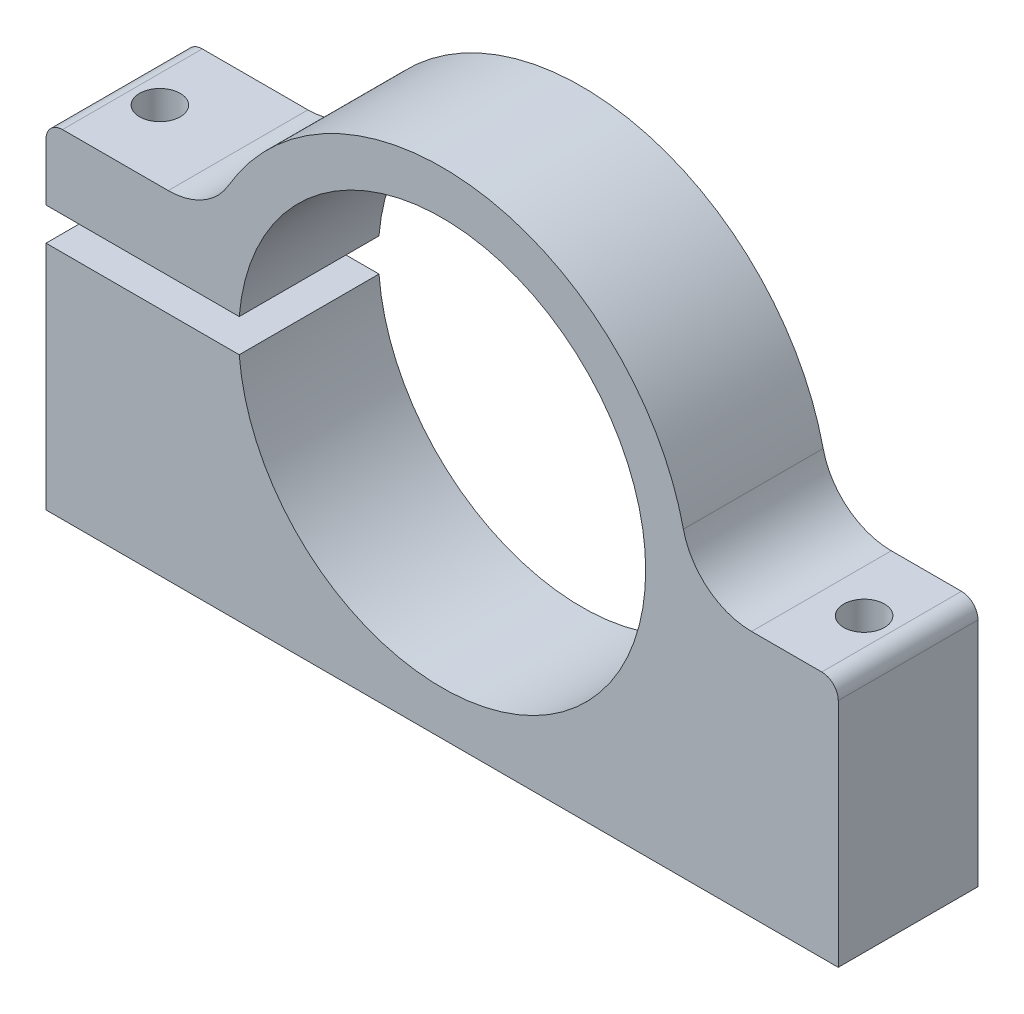
ISO-10303-21;
HEADER;
FILE_DESCRIPTION(('STEP AP214'),'2;1');
FILE_NAME('part.step','',(''),(''),'','','');
FILE_SCHEMA(('AUTOMOTIVE_DESIGN { 1 0 10303 214 1 1 1 1 }'));
ENDSEC;
DATA;
#1=APPLICATION_CONTEXT('core data for automotive mechanical design processes');
#2=APPLICATION_PROTOCOL_DEFINITION('international standard','automotive_design',2000,#1);
#3=PRODUCT_CONTEXT('',#1,'mechanical');
#4=PRODUCT('Part','Part','',(#3));
#5=PRODUCT_RELATED_PRODUCT_CATEGORY('part','',(#4));
#6=PRODUCT_DEFINITION_FORMATION('','',#4);
#7=PRODUCT_DEFINITION_CONTEXT('part definition',#1,'design');
#8=PRODUCT_DEFINITION('design','',#6,#7);
#9=PRODUCT_DEFINITION_SHAPE('','',#8);
#10=(LENGTH_UNIT() NAMED_UNIT(*) SI_UNIT(.MILLI.,.METRE.));
#11=(NAMED_UNIT(*) PLANE_ANGLE_UNIT() SI_UNIT($,.RADIAN.));
#12=(NAMED_UNIT(*) SI_UNIT($,.STERADIAN.) SOLID_ANGLE_UNIT());
#13=UNCERTAINTY_MEASURE_WITH_UNIT(LENGTH_MEASURE(1.E-05),#10,'distance_accuracy_value','');
#14=(GEOMETRIC_REPRESENTATION_CONTEXT(3) GLOBAL_UNCERTAINTY_ASSIGNED_CONTEXT((#13)) GLOBAL_UNIT_ASSIGNED_CONTEXT((#10,
#11,#12)) REPRESENTATION_CONTEXT('',''));
#15=CARTESIAN_POINT('',(0.,0.,0.));
#16=DIRECTION('',(0.,0.,1.));
#17=DIRECTION('',(1.,0.,0.));
#18=AXIS2_PLACEMENT_3D('',#15,#16,#17);
#19=CARTESIAN_POINT('',(-24.8593250544204,-22.3859153992928,0.400504127415026));
#20=DIRECTION('',(-1.,0.,0.));
#21=DIRECTION('',(0.,-1.,0.));
#22=AXIS2_PLACEMENT_3D('',#19,#20,#21);
#23=PLANE('',#22);
#24=DIRECTION('',(0.,1.,0.));
#25=VECTOR('',#24,1.);
#26=CARTESIAN_POINT('',(-24.8593250544204,-22.3859153992928,0.400504127415026));
#27=LINE('',#26,#25);
#28=CARTESIAN_POINT('',(-24.8593250544204,1.61408460070721,0.400504127415026));
#29=VERTEX_POINT('',#28);
#30=CARTESIAN_POINT('',(-24.8593250544204,6.80510216704338,0.400504127415026));
#31=VERTEX_POINT('',#30);
#32=EDGE_CURVE('E177',#29,#31,#27,.T.);
#33=ORIENTED_EDGE('',*,*,#32,.T.);
#34=DIRECTION('',(0.,0.,-1.));
#35=VECTOR('',#34,1.);
#36=CARTESIAN_POINT('',(-24.8593250544204,6.80510216704339,0.400504127415026));
#37=LINE('',#36,#35);
#38=CARTESIAN_POINT('',(-24.8593250544204,6.80510216704338,-12.299495872585));
#39=VERTEX_POINT('',#38);
#40=EDGE_CURVE('E209',#31,#39,#37,.T.);
#41=ORIENTED_EDGE('',*,*,#40,.T.);
#42=DIRECTION('',(0.,1.,0.));
#43=VECTOR('',#42,1.);
#44=CARTESIAN_POINT('',(-24.8593250544204,-22.3859153992928,-12.299495872585));
#45=LINE('',#44,#43);
#46=CARTESIAN_POINT('',(-24.8593250544204,1.61408460070721,-12.299495872585));
#47=VERTEX_POINT('',#46);
#48=EDGE_CURVE('E194',#47,#39,#45,.T.);
#49=ORIENTED_EDGE('',*,*,#48,.F.);
#50=DIRECTION('',(0.,0.,1.));
#51=VECTOR('',#50,1.);
#52=CARTESIAN_POINT('',(-24.8593250544204,1.61408460070721,-12.299495872585));
#53=LINE('',#52,#51);
#54=EDGE_CURVE('E160',#47,#29,#53,.T.);
#55=ORIENTED_EDGE('',*,*,#54,.T.);
#56=EDGE_LOOP('',(#33,#41,#49,#55));
#57=FACE_BOUND('',#56,.T.);
#58=ADVANCED_FACE('F34',(#57),#23,.T.);
#59=CARTESIAN_POINT('',(47.1406749455796,-22.3859153992928,0.400504127415026));
#60=DIRECTION('',(0.,-1.,0.));
#61=DIRECTION('',(0.,0.,-1.));
#62=AXIS2_PLACEMENT_3D('',#59,#60,#61);
#63=PLANE('',#62);
#64=CARTESIAN_POINT('',(-20.8593250544204,-22.3859153992928,-5.94949587258498));
#65=DIRECTION('',(0.,-1.,0.));
#66=DIRECTION('',(0.,0.,-1.));
#67=AXIS2_PLACEMENT_3D('',#64,#65,#66);
#68=CIRCLE('',#67,1.84999999999999);
#69=CARTESIAN_POINT('',(-20.8593250544204,-22.3859153992928,-7.79949587258497));
#70=VERTEX_POINT('',#69);
#71=EDGE_CURVE('E469',#70,#70,#68,.T.);
#72=ORIENTED_EDGE('',*,*,#71,.F.);
#73=EDGE_LOOP('',(#72));
#74=FACE_BOUND('',#73,.T.);
#75=CARTESIAN_POINT('',(43.1406749455796,-22.3859153992928,-5.94949587258498));
#76=DIRECTION('',(0.,1.,0.));
#77=DIRECTION('',(0.,0.,1.));
#78=AXIS2_PLACEMENT_3D('',#75,#76,#77);
#79=CIRCLE('',#78,1.84999999999998);
#80=CARTESIAN_POINT('',(43.1406749455796,-22.3859153992928,-4.09949587258499));
#81=VERTEX_POINT('',#80);
#82=EDGE_CURVE('E156',#81,#81,#79,.T.);
#83=ORIENTED_EDGE('',*,*,#82,.T.);
#84=EDGE_LOOP('',(#83));
#85=FACE_BOUND('',#84,.T.);
#86=DIRECTION('',(-1.,0.,0.));
#87=VECTOR('',#86,1.);
#88=CARTESIAN_POINT('',(47.1406749455796,-22.3859153992928,-12.299495872585));
#89=LINE('',#88,#87);
#90=CARTESIAN_POINT('',(47.1406749455796,-22.3859153992928,-12.299495872585));
#91=VERTEX_POINT('',#90);
#92=CARTESIAN_POINT('',(-24.8593250544204,-22.3859153992928,-12.299495872585));
#93=VERTEX_POINT('',#92);
#94=EDGE_CURVE('E144',#91,#93,#89,.T.);
#95=ORIENTED_EDGE('',*,*,#94,.F.);
#96=DIRECTION('',(0.,0.,-1.));
#97=VECTOR('',#96,1.);
#98=CARTESIAN_POINT('',(47.1406749455796,-22.3859153992928,0.400504127415026));
#99=LINE('',#98,#97);
#100=CARTESIAN_POINT('',(47.1406749455796,-22.3859153992928,0.400504127415026));
#101=VERTEX_POINT('',#100);
#102=EDGE_CURVE('E206',#101,#91,#99,.T.);
#103=ORIENTED_EDGE('',*,*,#102,.F.);
#104=DIRECTION('',(-1.,0.,0.));
#105=VECTOR('',#104,1.);
#106=CARTESIAN_POINT('',(47.1406749455796,-22.3859153992928,0.400504127415026));
#107=LINE('',#106,#105);
#108=CARTESIAN_POINT('',(-24.8593250544204,-22.3859153992928,0.400504127415026));
#109=VERTEX_POINT('',#108);
#110=EDGE_CURVE('E174',#101,#109,#107,.T.);
#111=ORIENTED_EDGE('',*,*,#110,.T.);
#112=DIRECTION('',(0.,0.,-1.));
#113=VECTOR('',#112,1.);
#114=CARTESIAN_POINT('',(-24.8593250544204,-22.3859153992928,0.400504127415026));
#115=LINE('',#114,#113);
#116=EDGE_CURVE('E191',#109,#93,#115,.T.);
#117=ORIENTED_EDGE('',*,*,#116,.T.);
#118=EDGE_LOOP('',(#95,#103,#111,#117));
#119=FACE_BOUND('',#118,.T.);
#120=ADVANCED_FACE('F269',(#74,#85,#119),#63,.T.);
#121=CARTESIAN_POINT('',(47.1406749455796,0.114084600707214,0.400504127415026));
#122=DIRECTION('',(1.,0.,0.));
#123=DIRECTION('',(0.,1.,0.));
#124=AXIS2_PLACEMENT_3D('',#121,#122,#123);
#125=PLANE('',#124);
#126=DIRECTION('',(0.,-1.,0.));
#127=VECTOR('',#126,1.);
#128=CARTESIAN_POINT('',(47.1406749455796,0.114084600707214,-12.299495872585));
#129=LINE('',#128,#127);
#130=CARTESIAN_POINT('',(47.1406749455796,-1.38591539929279,-12.299495872585));
#131=VERTEX_POINT('',#130);
#132=EDGE_CURVE('E178',#131,#91,#129,.T.);
#133=ORIENTED_EDGE('',*,*,#132,.F.);
#134=DIRECTION('',(0.,0.,-1.));
#135=VECTOR('',#134,1.);
#136=CARTESIAN_POINT('',(47.1406749455796,-1.38591539929279,0.400504127415026));
#137=LINE('',#136,#135);
#138=CARTESIAN_POINT('',(47.1406749455796,-1.38591539929279,0.400504127415026));
#139=VERTEX_POINT('',#138);
#140=EDGE_CURVE('E227',#131,#139,#137,.F.);
#141=ORIENTED_EDGE('',*,*,#140,.T.);
#142=DIRECTION('',(0.,-1.,0.));
#143=VECTOR('',#142,1.);
#144=CARTESIAN_POINT('',(47.1406749455796,0.114084600707214,0.400504127415026));
#145=LINE('',#144,#143);
#146=EDGE_CURVE('E189',#139,#101,#145,.T.);
#147=ORIENTED_EDGE('',*,*,#146,.T.);
#148=ORIENTED_EDGE('',*,*,#102,.T.);
#149=EDGE_LOOP('',(#133,#141,#147,#148));
#150=FACE_BOUND('',#149,.T.);
#151=ADVANCED_FACE('F287',(#150),#125,.T.);
#152=CARTESIAN_POINT('',(33.6206749455796,0.114084600707214,0.400504127415026));
#153=DIRECTION('',(0.,1.,0.));
#154=DIRECTION('',(-1.,0.,0.));
#155=AXIS2_PLACEMENT_3D('',#152,#153,#154);
#156=PLANE('',#155);
#157=CARTESIAN_POINT('',(43.1406749455796,0.114084600707215,-5.94949587258498));
#158=DIRECTION('',(0.,1.,0.));
#159=DIRECTION('',(0.,0.,1.));
#160=AXIS2_PLACEMENT_3D('',#157,#158,#159);
#161=CIRCLE('',#160,1.84999999999998);
#162=CARTESIAN_POINT('',(43.1406749455796,0.114084600707215,-4.09949587258499));
#163=VERTEX_POINT('',#162);
#164=EDGE_CURVE('E319',#163,#163,#161,.T.);
#165=ORIENTED_EDGE('',*,*,#164,.F.);
#166=EDGE_LOOP('',(#165));
#167=FACE_BOUND('',#166,.T.);
#168=DIRECTION('',(1.,0.,0.));
#169=VECTOR('',#168,1.);
#170=CARTESIAN_POINT('',(33.6206749455796,0.114084600707214,-12.299495872585));
#171=LINE('',#170,#169);
#172=CARTESIAN_POINT('',(39.2626663402159,0.114084600707214,-12.299495872585));
#173=VERTEX_POINT('',#172);
#174=CARTESIAN_POINT('',(45.6406749455796,0.114084600707214,-12.299495872585));
#175=VERTEX_POINT('',#174);
#176=EDGE_CURVE('E203',#173,#175,#171,.T.);
#177=ORIENTED_EDGE('',*,*,#176,.F.);
#178=DIRECTION('',(0.,0.,1.));
#179=VECTOR('',#178,1.);
#180=CARTESIAN_POINT('',(39.2626663402159,0.114084600707214,0.400504127415026));
#181=LINE('',#180,#179);
#182=CARTESIAN_POINT('',(39.2626663402159,0.114084600707214,0.400504127415026));
#183=VERTEX_POINT('',#182);
#184=EDGE_CURVE('E234',#173,#183,#181,.T.);
#185=ORIENTED_EDGE('',*,*,#184,.T.);
#186=DIRECTION('',(1.,0.,0.));
#187=VECTOR('',#186,1.);
#188=CARTESIAN_POINT('',(33.6206749455796,0.114084600707214,0.400504127415026));
#189=LINE('',#188,#187);
#190=CARTESIAN_POINT('',(45.6406749455796,0.114084600707214,0.400504127415026));
#191=VERTEX_POINT('',#190);
#192=EDGE_CURVE('E187',#183,#191,#189,.T.);
#193=ORIENTED_EDGE('',*,*,#192,.T.);
#194=DIRECTION('',(0.,0.,-1.));
#195=VECTOR('',#194,1.);
#196=CARTESIAN_POINT('',(45.6406749455796,0.114084600707214,0.400504127415026));
#197=LINE('',#196,#195);
#198=EDGE_CURVE('E224',#191,#175,#197,.T.);
#199=ORIENTED_EDGE('',*,*,#198,.T.);
#200=EDGE_LOOP('',(#177,#185,#193,#199));
#201=FACE_BOUND('',#200,.T.);
#202=ADVANCED_FACE('F282',(#167,#201),#156,.T.);
#203=CARTESIAN_POINT('',(11.1406749455796,0.114084600707214,0.400504127415026));
#204=DIRECTION('',(0.,0.,-1.));
#205=DIRECTION('',(-1.,0.,0.));
#206=AXIS2_PLACEMENT_3D('',#203,#204,#205);
#207=CYLINDRICAL_SURFACE('',#206,22.48);
#208=CARTESIAN_POINT('',(11.1406749455796,0.114084600707214,0.400504127415026));
#209=DIRECTION('',(0.,0.,-1.));
#210=DIRECTION('',(-1.,0.,0.));
#211=AXIS2_PLACEMENT_3D('',#208,#209,#210);
#212=CIRCLE('',#211,22.48);
#213=CARTESIAN_POINT('',(-8.27051330822913,11.4523459566294,0.400504127415026));
#214=VERTEX_POINT('',#213);
#215=CARTESIAN_POINT('',(33.068609962972,5.06545470129688,0.400504127415026));
#216=VERTEX_POINT('',#215);
#217=EDGE_CURVE('E184',#214,#216,#212,.T.);
#218=ORIENTED_EDGE('',*,*,#217,.T.);
#219=DIRECTION('',(0.,0.,-1.));
#220=VECTOR('',#219,1.);
#221=CARTESIAN_POINT('',(33.068609962972,5.06545470129688,0.400504127415026));
#222=LINE('',#221,#220);
#223=CARTESIAN_POINT('',(33.068609962972,5.06545470129688,-12.299495872585));
#224=VERTEX_POINT('',#223);
#225=EDGE_CURVE('E231',#216,#224,#222,.T.);
#226=ORIENTED_EDGE('',*,*,#225,.T.);
#227=CARTESIAN_POINT('',(11.1406749455796,0.114084600707214,-12.299495872585));
#228=DIRECTION('',(0.,0.,-1.));
#229=DIRECTION('',(-1.,0.,0.));
#230=AXIS2_PLACEMENT_3D('',#227,#228,#229);
#231=CIRCLE('',#230,22.48);
#232=CARTESIAN_POINT('',(-8.27051330822913,11.4523459566294,-12.299495872585));
#233=VERTEX_POINT('',#232);
#234=EDGE_CURVE('E200',#233,#224,#231,.T.);
#235=ORIENTED_EDGE('',*,*,#234,.F.);
#236=DIRECTION('',(0.,0.,-1.));
#237=VECTOR('',#236,1.);
#238=CARTESIAN_POINT('',(-8.27051330822913,11.4523459566294,0.400504127415026));
#239=LINE('',#238,#237);
#240=EDGE_CURVE('E229',#233,#214,#239,.F.);
#241=ORIENTED_EDGE('',*,*,#240,.T.);
#242=EDGE_LOOP('',(#218,#226,#235,#241));
#243=FACE_BOUND('',#242,.T.);
#244=ADVANCED_FACE('F244',(#243),#207,.T.);
#245=CARTESIAN_POINT('',(-24.8593250544204,8.30510216704339,0.400504127415026));
#246=DIRECTION('',(0.,1.,0.));
#247=DIRECTION('',(-1.,0.,0.));
#248=AXIS2_PLACEMENT_3D('',#245,#246,#247);
#249=PLANE('',#248);
#250=CARTESIAN_POINT('',(-20.8593250544204,8.30510216704339,-5.94949587258498));
#251=DIRECTION('',(0.,1.,0.));
#252=DIRECTION('',(-1.,0.,0.));
#253=AXIS2_PLACEMENT_3D('',#250,#251,#252);
#254=CIRCLE('',#253,1.84999999999999);
#255=CARTESIAN_POINT('',(-22.7093250544204,8.30510216704339,-5.94949587258498));
#256=VERTEX_POINT('',#255);
#257=EDGE_CURVE('E317',#256,#256,#254,.T.);
#258=ORIENTED_EDGE('',*,*,#257,.F.);
#259=EDGE_LOOP('',(#258));
#260=FACE_BOUND('',#259,.T.);
#261=DIRECTION('',(1.,0.,0.));
#262=VECTOR('',#261,1.);
#263=CARTESIAN_POINT('',(-24.8593250544204,8.30510216704339,0.400504127415026));
#264=LINE('',#263,#262);
#265=CARTESIAN_POINT('',(-23.3593250544204,8.30510216704339,0.400504127415026));
#266=VERTEX_POINT('',#265);
#267=CARTESIAN_POINT('',(-13.7536558977169,8.30510216704339,0.400504127415026));
#268=VERTEX_POINT('',#267);
#269=EDGE_CURVE('E182',#266,#268,#264,.T.);
#270=ORIENTED_EDGE('',*,*,#269,.T.);
#271=DIRECTION('',(0.,0.,1.));
#272=VECTOR('',#271,1.);
#273=CARTESIAN_POINT('',(-13.7536558977169,8.30510216704339,-12.299495872585));
#274=LINE('',#273,#272);
#275=CARTESIAN_POINT('',(-13.7536558977169,8.30510216704339,-12.299495872585));
#276=VERTEX_POINT('',#275);
#277=EDGE_CURVE('E236',#268,#276,#274,.F.);
#278=ORIENTED_EDGE('',*,*,#277,.T.);
#279=DIRECTION('',(1.,0.,0.));
#280=VECTOR('',#279,1.);
#281=CARTESIAN_POINT('',(-24.8593250544204,8.30510216704339,-12.299495872585));
#282=LINE('',#281,#280);
#283=CARTESIAN_POINT('',(-23.3593250544204,8.30510216704339,-12.299495872585));
#284=VERTEX_POINT('',#283);
#285=EDGE_CURVE('E197',#284,#276,#282,.T.);
#286=ORIENTED_EDGE('',*,*,#285,.F.);
#287=DIRECTION('',(0.,0.,-1.));
#288=VECTOR('',#287,1.);
#289=CARTESIAN_POINT('',(-23.3593250544204,8.30510216704339,0.400504127415026));
#290=LINE('',#289,#288);
#291=EDGE_CURVE('E217',#284,#266,#290,.F.);
#292=ORIENTED_EDGE('',*,*,#291,.T.);
#293=EDGE_LOOP('',(#270,#278,#286,#292));
#294=FACE_BOUND('',#293,.T.);
#295=ADVANCED_FACE('F247',(#260,#294),#249,.T.);
#296=DIRECTION('',(0.,0.,1.));
#297=VECTOR('',#296,1.);
#298=CARTESIAN_POINT('',(-24.8593250544204,-1.38591539929279,-12.299495872585));
#299=LINE('',#298,#297);
#300=CARTESIAN_POINT('',(-24.8593250544204,-1.38591539929279,-12.299495872585));
#301=VERTEX_POINT('',#300);
#302=CARTESIAN_POINT('',(-24.8593250544204,-1.38591539929279,0.400504127415026));
#303=VERTEX_POINT('',#302);
#304=EDGE_CURVE('E171',#301,#303,#299,.T.);
#305=ORIENTED_EDGE('',*,*,#304,.F.);
#306=EDGE_CURVE('E195',#93,#301,#45,.T.);
#307=ORIENTED_EDGE('',*,*,#306,.F.);
#308=ORIENTED_EDGE('',*,*,#116,.F.);
#309=EDGE_CURVE('E179',#109,#303,#27,.T.);
#310=ORIENTED_EDGE('',*,*,#309,.T.);
#311=EDGE_LOOP('',(#305,#307,#308,#310));
#312=FACE_BOUND('',#311,.T.);
#313=ADVANCED_FACE('F264',(#312),#23,.T.);
#314=CARTESIAN_POINT('',(11.1406749455796,0.114084600707214,0.400504127415026));
#315=DIRECTION('',(0.,0.,-1.));
#316=DIRECTION('',(-1.,0.,0.));
#317=AXIS2_PLACEMENT_3D('',#314,#315,#316);
#318=PLANE('',#317);
#319=ORIENTED_EDGE('',*,*,#269,.F.);
#320=CARTESIAN_POINT('',(-23.3593250544204,6.80510216704339,0.400504127415026));
#321=DIRECTION('',(0.,0.,-1.));
#322=DIRECTION('',(-1.,0.,0.));
#323=AXIS2_PLACEMENT_3D('',#320,#321,#322);
#324=CIRCLE('',#323,1.5);
#325=EDGE_CURVE('E222',#266,#31,#324,.F.);
#326=ORIENTED_EDGE('',*,*,#325,.T.);
#327=ORIENTED_EDGE('',*,*,#32,.F.);
#328=DIRECTION('',(-1.,0.,0.));
#329=VECTOR('',#328,1.);
#330=CARTESIAN_POINT('',(-7.2984139690062,1.61408460070721,0.400504127415026));
#331=LINE('',#330,#329);
#332=CARTESIAN_POINT('',(-7.2984139690062,1.61408460070721,0.400504127415024));
#333=VERTEX_POINT('',#332);
#334=EDGE_CURVE('E165',#333,#29,#331,.T.);
#335=ORIENTED_EDGE('',*,*,#334,.F.);
#336=CARTESIAN_POINT('',(11.1406749455796,0.114084600707214,0.400504127415024));
#337=DIRECTION('',(0.,0.,-1.));
#338=DIRECTION('',(-1.,0.,0.));
#339=AXIS2_PLACEMENT_3D('',#336,#337,#338);
#340=CIRCLE('',#339,18.5);
#341=CARTESIAN_POINT('',(-7.29841396900619,-1.38591539929284,0.400504127415024));
#342=VERTEX_POINT('',#341);
#343=EDGE_CURVE('E140',#333,#342,#340,.T.);
#344=ORIENTED_EDGE('',*,*,#343,.T.);
#345=DIRECTION('',(1.,0.,0.));
#346=VECTOR('',#345,1.);
#347=CARTESIAN_POINT('',(-24.8593250544204,-1.38591539929279,0.400504127415026));
#348=LINE('',#347,#346);
#349=EDGE_CURVE('E161',#303,#342,#348,.T.);
#350=ORIENTED_EDGE('',*,*,#349,.F.);
#351=ORIENTED_EDGE('',*,*,#309,.F.);
#352=ORIENTED_EDGE('',*,*,#110,.F.);
#353=ORIENTED_EDGE('',*,*,#146,.F.);
#354=CARTESIAN_POINT('',(45.6406749455796,-1.38591539929279,0.400504127415026));
#355=DIRECTION('',(0.,0.,-1.));
#356=DIRECTION('',(-1.,0.,0.));
#357=AXIS2_PLACEMENT_3D('',#354,#355,#356);
#358=CIRCLE('',#357,1.5);
#359=EDGE_CURVE('E219',#139,#191,#358,.F.);
#360=ORIENTED_EDGE('',*,*,#359,.T.);
#361=ORIENTED_EDGE('',*,*,#192,.F.);
#362=CARTESIAN_POINT('',(39.2626663402159,6.46408460070721,0.400504127415026));
#363=DIRECTION('',(0.,0.,-1.));
#364=DIRECTION('',(-1.,0.,0.));
#365=AXIS2_PLACEMENT_3D('',#362,#363,#364);
#366=CIRCLE('',#365,6.35);
#367=EDGE_CURVE('E240',#183,#216,#366,.T.);
#368=ORIENTED_EDGE('',*,*,#367,.T.);
#369=ORIENTED_EDGE('',*,*,#217,.F.);
#370=CARTESIAN_POINT('',(-13.7536558977169,14.6551021670434,0.400504127415026));
#371=DIRECTION('',(0.,0.,-1.));
#372=DIRECTION('',(-1.,0.,0.));
#373=AXIS2_PLACEMENT_3D('',#370,#371,#372);
#374=CIRCLE('',#373,6.35);
#375=EDGE_CURVE('E11',#214,#268,#374,.T.);
#376=ORIENTED_EDGE('',*,*,#375,.T.);
#377=EDGE_LOOP('',(#319,#326,#327,#335,#344,#350,#351,#352,#353,#360,#361,#368,#369,#376));
#378=FACE_BOUND('',#377,.T.);
#379=ADVANCED_FACE('F250',(#378),#318,.F.);
#380=CARTESIAN_POINT('',(11.1406749455796,0.114084600707214,-12.299495872585));
#381=DIRECTION('',(0.,0.,-1.));
#382=DIRECTION('',(-1.,0.,0.));
#383=AXIS2_PLACEMENT_3D('',#380,#381,#382);
#384=PLANE('',#383);
#385=ORIENTED_EDGE('',*,*,#48,.T.);
#386=CARTESIAN_POINT('',(-23.3593250544204,6.80510216704339,-12.299495872585));
#387=DIRECTION('',(0.,0.,-1.));
#388=DIRECTION('',(-1.,0.,0.));
#389=AXIS2_PLACEMENT_3D('',#386,#387,#388);
#390=CIRCLE('',#389,1.5);
#391=EDGE_CURVE('E215',#39,#284,#390,.T.);
#392=ORIENTED_EDGE('',*,*,#391,.T.);
#393=ORIENTED_EDGE('',*,*,#285,.T.);
#394=CARTESIAN_POINT('',(-13.7536558977169,14.6551021670434,-12.299495872585));
#395=DIRECTION('',(0.,0.,-1.));
#396=DIRECTION('',(-1.,0.,0.));
#397=AXIS2_PLACEMENT_3D('',#394,#395,#396);
#398=CIRCLE('',#397,6.35);
#399=EDGE_CURVE('E42',#276,#233,#398,.F.);
#400=ORIENTED_EDGE('',*,*,#399,.T.);
#401=ORIENTED_EDGE('',*,*,#234,.T.);
#402=CARTESIAN_POINT('',(39.2626663402159,6.46408460070721,-12.299495872585));
#403=DIRECTION('',(0.,0.,-1.));
#404=DIRECTION('',(-1.,0.,0.));
#405=AXIS2_PLACEMENT_3D('',#402,#403,#404);
#406=CIRCLE('',#405,6.35);
#407=EDGE_CURVE('E238',#224,#173,#406,.F.);
#408=ORIENTED_EDGE('',*,*,#407,.T.);
#409=ORIENTED_EDGE('',*,*,#176,.T.);
#410=CARTESIAN_POINT('',(45.6406749455796,-1.38591539929279,-12.299495872585));
#411=DIRECTION('',(0.,0.,-1.));
#412=DIRECTION('',(-1.,0.,0.));
#413=AXIS2_PLACEMENT_3D('',#410,#411,#412);
#414=CIRCLE('',#413,1.5);
#415=EDGE_CURVE('E213',#175,#131,#414,.T.);
#416=ORIENTED_EDGE('',*,*,#415,.T.);
#417=ORIENTED_EDGE('',*,*,#132,.T.);
#418=ORIENTED_EDGE('',*,*,#94,.T.);
#419=ORIENTED_EDGE('',*,*,#306,.T.);
#420=DIRECTION('',(1.,0.,0.));
#421=VECTOR('',#420,1.);
#422=CARTESIAN_POINT('',(-24.8593250544204,-1.38591539929279,-12.299495872585));
#423=LINE('',#422,#421);
#424=CARTESIAN_POINT('',(-7.29841396900619,-1.38591539929284,-12.299495872585));
#425=VERTEX_POINT('',#424);
#426=EDGE_CURVE('E155',#301,#425,#423,.T.);
#427=ORIENTED_EDGE('',*,*,#426,.T.);
#428=CARTESIAN_POINT('',(11.1406749455796,0.114084600707214,-12.299495872585));
#429=DIRECTION('',(0.,0.,-1.));
#430=DIRECTION('',(-1.,0.,0.));
#431=AXIS2_PLACEMENT_3D('',#428,#429,#430);
#432=CIRCLE('',#431,18.5);
#433=CARTESIAN_POINT('',(-7.2984139690062,1.61408460070721,-12.299495872585));
#434=VERTEX_POINT('',#433);
#435=EDGE_CURVE('E137',#434,#425,#432,.T.);
#436=ORIENTED_EDGE('',*,*,#435,.F.);
#437=DIRECTION('',(-1.,0.,0.));
#438=VECTOR('',#437,1.);
#439=CARTESIAN_POINT('',(-7.2984139690062,1.61408460070721,-12.299495872585));
#440=LINE('',#439,#438);
#441=EDGE_CURVE('E152',#434,#47,#440,.T.);
#442=ORIENTED_EDGE('',*,*,#441,.T.);
#443=EDGE_LOOP('',(#385,#392,#393,#400,#401,#408,#409,#416,#417,#418,#419,#427,#436,#442));
#444=FACE_BOUND('',#443,.T.);
#445=ADVANCED_FACE('F151',(#444),#384,.T.);
#446=CARTESIAN_POINT('',(-7.2984139690062,1.61408460070721,-12.299495872585));
#447=DIRECTION('',(0.,1.,0.));
#448=DIRECTION('',(-1.,0.,0.));
#449=AXIS2_PLACEMENT_3D('',#446,#447,#448);
#450=PLANE('',#449);
#451=CARTESIAN_POINT('',(-20.8593250544204,1.61408460070721,-5.94949587258498));
#452=DIRECTION('',(0.,-1.,0.));
#453=DIRECTION('',(0.,0.,-1.));
#454=AXIS2_PLACEMENT_3D('',#451,#452,#453);
#455=CIRCLE('',#454,1.84999999999999);
#456=CARTESIAN_POINT('',(-20.8593250544204,1.61408460070721,-7.79949587258496));
#457=VERTEX_POINT('',#456);
#458=EDGE_CURVE('E320',#457,#457,#455,.T.);
#459=ORIENTED_EDGE('',*,*,#458,.F.);
#460=EDGE_LOOP('',(#459));
#461=FACE_BOUND('',#460,.T.);
#462=ORIENTED_EDGE('',*,*,#334,.T.);
#463=ORIENTED_EDGE('',*,*,#54,.F.);
#464=ORIENTED_EDGE('',*,*,#441,.F.);
#465=DIRECTION('',(0.,0.,1.));
#466=VECTOR('',#465,1.);
#467=CARTESIAN_POINT('',(-7.2984139690062,1.61408460070721,-12.299495872585));
#468=LINE('',#467,#466);
#469=EDGE_CURVE('E134',#434,#333,#468,.T.);
#470=ORIENTED_EDGE('',*,*,#469,.T.);
#471=EDGE_LOOP('',(#462,#463,#464,#470));
#472=FACE_BOUND('',#471,.T.);
#473=ADVANCED_FACE('F158',(#461,#472),#450,.F.);
#474=CARTESIAN_POINT('',(-24.8593250544204,-1.38591539929279,-12.299495872585));
#475=DIRECTION('',(0.,-1.,0.));
#476=DIRECTION('',(1.,0.,0.));
#477=AXIS2_PLACEMENT_3D('',#474,#475,#476);
#478=PLANE('',#477);
#479=CARTESIAN_POINT('',(-20.8593250544204,-1.3859153992928,-5.94949587258498));
#480=DIRECTION('',(0.,-1.,0.));
#481=DIRECTION('',(1.,0.,0.));
#482=AXIS2_PLACEMENT_3D('',#479,#480,#481);
#483=CIRCLE('',#482,1.84999999999999);
#484=CARTESIAN_POINT('',(-19.0093250544204,-1.38591539929281,-5.94949587258498));
#485=VERTEX_POINT('',#484);
#486=EDGE_CURVE('E325',#485,#485,#483,.T.);
#487=ORIENTED_EDGE('',*,*,#486,.T.);
#488=EDGE_LOOP('',(#487));
#489=FACE_BOUND('',#488,.T.);
#490=ORIENTED_EDGE('',*,*,#349,.T.);
#491=DIRECTION('',(0.,0.,1.));
#492=VECTOR('',#491,1.);
#493=CARTESIAN_POINT('',(-7.29841396900619,-1.38591539929284,-12.299495872585));
#494=LINE('',#493,#492);
#495=EDGE_CURVE('E145',#425,#342,#494,.T.);
#496=ORIENTED_EDGE('',*,*,#495,.F.);
#497=ORIENTED_EDGE('',*,*,#426,.F.);
#498=ORIENTED_EDGE('',*,*,#304,.T.);
#499=EDGE_LOOP('',(#490,#496,#497,#498));
#500=FACE_BOUND('',#499,.T.);
#501=ADVANCED_FACE('F260',(#489,#500),#478,.F.);
#502=CARTESIAN_POINT('',(11.1406749455796,0.114084600707214,0.400504127415024));
#503=DIRECTION('',(0.,0.,-1.));
#504=DIRECTION('',(-1.,0.,0.));
#505=AXIS2_PLACEMENT_3D('',#502,#503,#504);
#506=CYLINDRICAL_SURFACE('',#505,18.5);
#507=ORIENTED_EDGE('',*,*,#435,.T.);
#508=ORIENTED_EDGE('',*,*,#495,.T.);
#509=ORIENTED_EDGE('',*,*,#343,.F.);
#510=ORIENTED_EDGE('',*,*,#469,.F.);
#511=EDGE_LOOP('',(#507,#508,#509,#510));
#512=FACE_BOUND('',#511,.T.);
#513=ADVANCED_FACE('F136',(#512),#506,.F.);
#514=CARTESIAN_POINT('',(43.1406749455796,0.114084600707214,-5.94949587258498));
#515=DIRECTION('',(0.,1.,0.));
#516=DIRECTION('',(0.,0.,1.));
#517=AXIS2_PLACEMENT_3D('',#514,#515,#516);
#518=CYLINDRICAL_SURFACE('',#517,1.84999999999998);
#519=ORIENTED_EDGE('',*,*,#82,.F.);
#520=EDGE_LOOP('',(#519));
#521=FACE_BOUND('',#520,.T.);
#522=ORIENTED_EDGE('',*,*,#164,.T.);
#523=EDGE_LOOP('',(#522));
#524=FACE_BOUND('',#523,.T.);
#525=ADVANCED_FACE('F333',(#521,#524),#518,.F.);
#526=CARTESIAN_POINT('',(-20.8593250544204,1.61408460070721,-5.94949587258498));
#527=DIRECTION('',(0.,-1.,0.));
#528=DIRECTION('',(0.,0.,-1.));
#529=AXIS2_PLACEMENT_3D('',#526,#527,#528);
#530=CYLINDRICAL_SURFACE('',#529,1.84999999999999);
#531=ORIENTED_EDGE('',*,*,#257,.T.);
#532=EDGE_LOOP('',(#531));
#533=FACE_BOUND('',#532,.T.);
#534=ORIENTED_EDGE('',*,*,#458,.T.);
#535=EDGE_LOOP('',(#534));
#536=FACE_BOUND('',#535,.T.);
#537=ADVANCED_FACE('F336',(#533,#536),#530,.F.);
#538=CARTESIAN_POINT('',(-20.8593250544204,-22.3859153992928,-5.94949587258498));
#539=DIRECTION('',(0.,-1.,0.));
#540=DIRECTION('',(0.,0.,-1.));
#541=AXIS2_PLACEMENT_3D('',#538,#539,#540);
#542=CYLINDRICAL_SURFACE('',#541,1.84999999999999);
#543=ORIENTED_EDGE('',*,*,#71,.T.);
#544=EDGE_LOOP('',(#543));
#545=FACE_BOUND('',#544,.T.);
#546=ORIENTED_EDGE('',*,*,#486,.F.);
#547=EDGE_LOOP('',(#546));
#548=FACE_BOUND('',#547,.T.);
#549=ADVANCED_FACE('F343',(#545,#548),#542,.F.);
#550=CARTESIAN_POINT('',(-23.3593250544204,6.80510216704339,0.400504127415026));
#551=DIRECTION('',(0.,0.,-1.));
#552=DIRECTION('',(-1.,0.,0.));
#553=AXIS2_PLACEMENT_3D('',#550,#551,#552);
#554=CYLINDRICAL_SURFACE('',#553,1.5);
#555=ORIENTED_EDGE('',*,*,#325,.F.);
#556=ORIENTED_EDGE('',*,*,#291,.F.);
#557=ORIENTED_EDGE('',*,*,#391,.F.);
#558=ORIENTED_EDGE('',*,*,#40,.F.);
#559=EDGE_LOOP('',(#555,#556,#557,#558));
#560=FACE_BOUND('',#559,.T.);
#561=ADVANCED_FACE('F255',(#560),#554,.T.);
#562=CARTESIAN_POINT('',(45.6406749455796,-1.38591539929279,0.400504127415026));
#563=DIRECTION('',(0.,0.,-1.));
#564=DIRECTION('',(-1.,0.,0.));
#565=AXIS2_PLACEMENT_3D('',#562,#563,#564);
#566=CYLINDRICAL_SURFACE('',#565,1.5);
#567=ORIENTED_EDGE('',*,*,#359,.F.);
#568=ORIENTED_EDGE('',*,*,#140,.F.);
#569=ORIENTED_EDGE('',*,*,#415,.F.);
#570=ORIENTED_EDGE('',*,*,#198,.F.);
#571=EDGE_LOOP('',(#567,#568,#569,#570));
#572=FACE_BOUND('',#571,.T.);
#573=ADVANCED_FACE('F278',(#572),#566,.T.);
#574=CARTESIAN_POINT('',(39.2626663402159,6.46408460070721,0.400504127415026));
#575=DIRECTION('',(0.,0.,-1.));
#576=DIRECTION('',(-1.,0.,0.));
#577=AXIS2_PLACEMENT_3D('',#574,#575,#576);
#578=CYLINDRICAL_SURFACE('',#577,6.35);
#579=ORIENTED_EDGE('',*,*,#367,.F.);
#580=ORIENTED_EDGE('',*,*,#184,.F.);
#581=ORIENTED_EDGE('',*,*,#407,.F.);
#582=ORIENTED_EDGE('',*,*,#225,.F.);
#583=EDGE_LOOP('',(#579,#580,#581,#582));
#584=FACE_BOUND('',#583,.T.);
#585=ADVANCED_FACE('F286',(#584),#578,.F.);
#586=CARTESIAN_POINT('',(-13.7536558977169,14.6551021670434,0.400504127415026));
#587=DIRECTION('',(0.,0.,-1.));
#588=DIRECTION('',(-1.,0.,0.));
#589=AXIS2_PLACEMENT_3D('',#586,#587,#588);
#590=CYLINDRICAL_SURFACE('',#589,6.35);
#591=ORIENTED_EDGE('',*,*,#375,.F.);
#592=ORIENTED_EDGE('',*,*,#240,.F.);
#593=ORIENTED_EDGE('',*,*,#399,.F.);
#594=ORIENTED_EDGE('',*,*,#277,.F.);
#595=EDGE_LOOP('',(#591,#592,#593,#594));
#596=FACE_BOUND('',#595,.T.);
#597=ADVANCED_FACE('F36',(#596),#590,.F.);
#598=CLOSED_SHELL('',(#58,#120,#151,#202,#244,#295,#313,#379,#445,#473,#501,#513,#525,#537,#549,
#561,#573,#585,#597));
#599=MANIFOLD_SOLID_BREP('B2',#598);
#600=ADVANCED_BREP_SHAPE_REPRESENTATION('',(#18,#599),#14);
#601=SHAPE_DEFINITION_REPRESENTATION(#9,#600);
ENDSEC;
END-ISO-10303-21;
